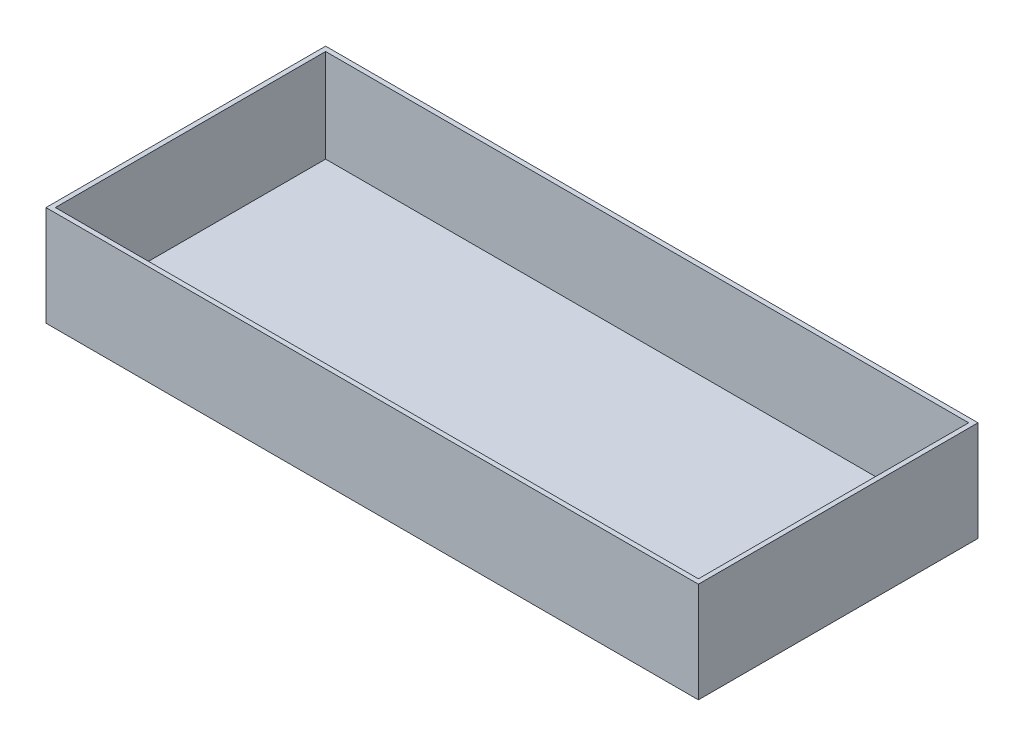
ISO-10303-21;
HEADER;
FILE_DESCRIPTION(('STEP AP214'),'2;1');
FILE_NAME('part.step','',(''),(''),'','','');
FILE_SCHEMA(('AUTOMOTIVE_DESIGN { 1 0 10303 214 1 1 1 1 }'));
ENDSEC;
DATA;
#1=APPLICATION_CONTEXT('core data for automotive mechanical design processes');
#2=APPLICATION_PROTOCOL_DEFINITION('international standard','automotive_design',2000,#1);
#3=PRODUCT_CONTEXT('',#1,'mechanical');
#4=PRODUCT('Part','Part','',(#3));
#5=PRODUCT_RELATED_PRODUCT_CATEGORY('part','',(#4));
#6=PRODUCT_DEFINITION_FORMATION('','',#4);
#7=PRODUCT_DEFINITION_CONTEXT('part definition',#1,'design');
#8=PRODUCT_DEFINITION('design','',#6,#7);
#9=PRODUCT_DEFINITION_SHAPE('','',#8);
#10=(LENGTH_UNIT() NAMED_UNIT(*) SI_UNIT(.MILLI.,.METRE.));
#11=(NAMED_UNIT(*) PLANE_ANGLE_UNIT() SI_UNIT($,.RADIAN.));
#12=(NAMED_UNIT(*) SI_UNIT($,.STERADIAN.) SOLID_ANGLE_UNIT());
#13=UNCERTAINTY_MEASURE_WITH_UNIT(LENGTH_MEASURE(1.E-05),#10,'distance_accuracy_value','');
#14=(GEOMETRIC_REPRESENTATION_CONTEXT(3) GLOBAL_UNCERTAINTY_ASSIGNED_CONTEXT((#13)) GLOBAL_UNIT_ASSIGNED_CONTEXT((#10,
#11,#12)) REPRESENTATION_CONTEXT('',''));
#15=CARTESIAN_POINT('',(0.,0.,0.));
#16=DIRECTION('',(0.,0.,1.));
#17=DIRECTION('',(1.,0.,0.));
#18=AXIS2_PLACEMENT_3D('',#15,#16,#17);
#19=CARTESIAN_POINT('',(0.,3.,0.));
#20=DIRECTION('',(1.,0.,0.));
#21=DIRECTION('',(0.,0.,-1.));
#22=AXIS2_PLACEMENT_3D('',#19,#20,#21);
#23=PLANE('',#22);
#24=DIRECTION('',(0.,0.,1.));
#25=VECTOR('',#24,1.);
#26=CARTESIAN_POINT('',(0.,0.,0.));
#27=LINE('',#26,#25);
#28=CARTESIAN_POINT('',(0.,0.,0.));
#29=VERTEX_POINT('',#28);
#30=CARTESIAN_POINT('',(0.,0.,120.));
#31=VERTEX_POINT('',#30);
#32=EDGE_CURVE('E144',#29,#31,#27,.T.);
#33=ORIENTED_EDGE('',*,*,#32,.T.);
#34=DIRECTION('',(0.,-1.,0.));
#35=VECTOR('',#34,1.);
#36=CARTESIAN_POINT('',(0.,3.,120.));
#37=LINE('',#36,#35);
#38=CARTESIAN_POINT('',(0.,43.,120.));
#39=VERTEX_POINT('',#38);
#40=EDGE_CURVE('E11',#39,#31,#37,.T.);
#41=ORIENTED_EDGE('',*,*,#40,.F.);
#42=DIRECTION('',(0.,0.,1.));
#43=VECTOR('',#42,1.);
#44=CARTESIAN_POINT('',(0.,43.,0.));
#45=LINE('',#44,#43);
#46=CARTESIAN_POINT('',(0.,43.,0.));
#47=VERTEX_POINT('',#46);
#48=EDGE_CURVE('E111',#47,#39,#45,.T.);
#49=ORIENTED_EDGE('',*,*,#48,.F.);
#50=DIRECTION('',(0.,-1.,0.));
#51=VECTOR('',#50,1.);
#52=CARTESIAN_POINT('',(0.,3.,0.));
#53=LINE('',#52,#51);
#54=EDGE_CURVE('E153',#47,#29,#53,.T.);
#55=ORIENTED_EDGE('',*,*,#54,.T.);
#56=EDGE_LOOP('',(#33,#41,#49,#55));
#57=FACE_BOUND('',#56,.T.);
#58=ADVANCED_FACE('F33',(#57),#23,.F.);
#59=CARTESIAN_POINT('',(0.,3.,120.));
#60=DIRECTION('',(0.,0.,-1.));
#61=DIRECTION('',(-1.,0.,0.));
#62=AXIS2_PLACEMENT_3D('',#59,#60,#61);
#63=PLANE('',#62);
#64=DIRECTION('',(1.,0.,0.));
#65=VECTOR('',#64,1.);
#66=CARTESIAN_POINT('',(0.,0.,120.));
#67=LINE('',#66,#65);
#68=CARTESIAN_POINT('',(280.,0.,120.));
#69=VERTEX_POINT('',#68);
#70=EDGE_CURVE('E147',#31,#69,#67,.T.);
#71=ORIENTED_EDGE('',*,*,#70,.T.);
#72=DIRECTION('',(0.,-1.,0.));
#73=VECTOR('',#72,1.);
#74=CARTESIAN_POINT('',(280.,3.,120.));
#75=LINE('',#74,#73);
#76=CARTESIAN_POINT('',(280.,43.,120.));
#77=VERTEX_POINT('',#76);
#78=EDGE_CURVE('E40',#77,#69,#75,.T.);
#79=ORIENTED_EDGE('',*,*,#78,.F.);
#80=DIRECTION('',(1.,0.,0.));
#81=VECTOR('',#80,1.);
#82=CARTESIAN_POINT('',(0.,43.,120.));
#83=LINE('',#82,#81);
#84=EDGE_CURVE('E135',#39,#77,#83,.T.);
#85=ORIENTED_EDGE('',*,*,#84,.F.);
#86=ORIENTED_EDGE('',*,*,#40,.T.);
#87=EDGE_LOOP('',(#71,#79,#85,#86));
#88=FACE_BOUND('',#87,.T.);
#89=ADVANCED_FACE('F175',(#88),#63,.F.);
#90=CARTESIAN_POINT('',(280.,3.,0.));
#91=DIRECTION('',(-1.,0.,0.));
#92=DIRECTION('',(0.,0.,1.));
#93=AXIS2_PLACEMENT_3D('',#90,#91,#92);
#94=PLANE('',#93);
#95=DIRECTION('',(0.,0.,-1.));
#96=VECTOR('',#95,1.);
#97=CARTESIAN_POINT('',(280.,0.,0.));
#98=LINE('',#97,#96);
#99=CARTESIAN_POINT('',(280.,0.,0.));
#100=VERTEX_POINT('',#99);
#101=EDGE_CURVE('E149',#69,#100,#98,.T.);
#102=ORIENTED_EDGE('',*,*,#101,.T.);
#103=DIRECTION('',(0.,-1.,0.));
#104=VECTOR('',#103,1.);
#105=CARTESIAN_POINT('',(280.,3.,0.));
#106=LINE('',#105,#104);
#107=CARTESIAN_POINT('',(280.,43.,0.));
#108=VERTEX_POINT('',#107);
#109=EDGE_CURVE('E156',#108,#100,#106,.T.);
#110=ORIENTED_EDGE('',*,*,#109,.F.);
#111=DIRECTION('',(0.,0.,-1.));
#112=VECTOR('',#111,1.);
#113=CARTESIAN_POINT('',(280.,43.,0.));
#114=LINE('',#113,#112);
#115=EDGE_CURVE('E138',#77,#108,#114,.T.);
#116=ORIENTED_EDGE('',*,*,#115,.F.);
#117=ORIENTED_EDGE('',*,*,#78,.T.);
#118=EDGE_LOOP('',(#102,#110,#116,#117));
#119=FACE_BOUND('',#118,.T.);
#120=ADVANCED_FACE('F162',(#119),#94,.F.);
#121=CARTESIAN_POINT('',(0.,3.,0.));
#122=DIRECTION('',(0.,0.,1.));
#123=DIRECTION('',(1.,0.,0.));
#124=AXIS2_PLACEMENT_3D('',#121,#122,#123);
#125=PLANE('',#124);
#126=DIRECTION('',(-1.,0.,0.));
#127=VECTOR('',#126,1.);
#128=CARTESIAN_POINT('',(0.,0.,0.));
#129=LINE('',#128,#127);
#130=EDGE_CURVE('E151',#100,#29,#129,.T.);
#131=ORIENTED_EDGE('',*,*,#130,.T.);
#132=ORIENTED_EDGE('',*,*,#54,.F.);
#133=DIRECTION('',(-1.,0.,0.));
#134=VECTOR('',#133,1.);
#135=CARTESIAN_POINT('',(0.,43.,0.));
#136=LINE('',#135,#134);
#137=EDGE_CURVE('E141',#108,#47,#136,.T.);
#138=ORIENTED_EDGE('',*,*,#137,.F.);
#139=ORIENTED_EDGE('',*,*,#109,.T.);
#140=EDGE_LOOP('',(#131,#132,#138,#139));
#141=FACE_BOUND('',#140,.T.);
#142=ADVANCED_FACE('F170',(#141),#125,.F.);
#143=CARTESIAN_POINT('',(0.,0.,0.));
#144=DIRECTION('',(0.,1.,0.));
#145=DIRECTION('',(0.,0.,1.));
#146=AXIS2_PLACEMENT_3D('',#143,#144,#145);
#147=PLANE('',#146);
#148=ORIENTED_EDGE('',*,*,#32,.F.);
#149=ORIENTED_EDGE('',*,*,#130,.F.);
#150=ORIENTED_EDGE('',*,*,#101,.F.);
#151=ORIENTED_EDGE('',*,*,#70,.F.);
#152=EDGE_LOOP('',(#148,#149,#150,#151));
#153=FACE_BOUND('',#152,.T.);
#154=ADVANCED_FACE('F168',(#153),#147,.F.);
#155=CARTESIAN_POINT('',(0.,43.,0.));
#156=DIRECTION('',(0.,1.,0.));
#157=DIRECTION('',(0.,0.,1.));
#158=AXIS2_PLACEMENT_3D('',#155,#156,#157);
#159=PLANE('',#158);
#160=ORIENTED_EDGE('',*,*,#48,.T.);
#161=ORIENTED_EDGE('',*,*,#84,.T.);
#162=ORIENTED_EDGE('',*,*,#115,.T.);
#163=ORIENTED_EDGE('',*,*,#137,.T.);
#164=EDGE_LOOP('',(#160,#161,#162,#163));
#165=FACE_BOUND('',#164,.T.);
#166=DIRECTION('',(0.,0.,1.));
#167=VECTOR('',#166,1.);
#168=CARTESIAN_POINT('',(2.,43.,2.));
#169=LINE('',#168,#167);
#170=CARTESIAN_POINT('',(2.,43.,2.));
#171=VERTEX_POINT('',#170);
#172=CARTESIAN_POINT('',(2.,43.,118.));
#173=VERTEX_POINT('',#172);
#174=EDGE_CURVE('E105',#171,#173,#169,.T.);
#175=ORIENTED_EDGE('',*,*,#174,.F.);
#176=DIRECTION('',(-1.,0.,0.));
#177=VECTOR('',#176,1.);
#178=CARTESIAN_POINT('',(2.,43.,2.));
#179=LINE('',#178,#177);
#180=CARTESIAN_POINT('',(278.,43.,2.));
#181=VERTEX_POINT('',#180);
#182=EDGE_CURVE('E96',#181,#171,#179,.T.);
#183=ORIENTED_EDGE('',*,*,#182,.F.);
#184=DIRECTION('',(0.,0.,-1.));
#185=VECTOR('',#184,1.);
#186=CARTESIAN_POINT('',(278.,43.,2.));
#187=LINE('',#186,#185);
#188=CARTESIAN_POINT('',(278.,43.,118.));
#189=VERTEX_POINT('',#188);
#190=EDGE_CURVE('E119',#189,#181,#187,.T.);
#191=ORIENTED_EDGE('',*,*,#190,.F.);
#192=DIRECTION('',(1.,0.,0.));
#193=VECTOR('',#192,1.);
#194=CARTESIAN_POINT('',(2.,43.,118.));
#195=LINE('',#194,#193);
#196=EDGE_CURVE('E117',#173,#189,#195,.T.);
#197=ORIENTED_EDGE('',*,*,#196,.F.);
#198=EDGE_LOOP('',(#175,#183,#191,#197));
#199=FACE_BOUND('',#198,.T.);
#200=ADVANCED_FACE('F115',(#165,#199),#159,.T.);
#201=CARTESIAN_POINT('',(2.,43.,2.));
#202=DIRECTION('',(0.,0.,1.));
#203=DIRECTION('',(1.,0.,0.));
#204=AXIS2_PLACEMENT_3D('',#201,#202,#203);
#205=PLANE('',#204);
#206=DIRECTION('',(-1.,0.,0.));
#207=VECTOR('',#206,1.);
#208=CARTESIAN_POINT('',(2.,3.,2.));
#209=LINE('',#208,#207);
#210=CARTESIAN_POINT('',(278.,3.,2.));
#211=VERTEX_POINT('',#210);
#212=CARTESIAN_POINT('',(2.,3.,2.));
#213=VERTEX_POINT('',#212);
#214=EDGE_CURVE('E47',#211,#213,#209,.T.);
#215=ORIENTED_EDGE('',*,*,#214,.F.);
#216=DIRECTION('',(0.,-1.,0.));
#217=VECTOR('',#216,1.);
#218=CARTESIAN_POINT('',(278.,43.,2.));
#219=LINE('',#218,#217);
#220=EDGE_CURVE('E101',#181,#211,#219,.T.);
#221=ORIENTED_EDGE('',*,*,#220,.F.);
#222=ORIENTED_EDGE('',*,*,#182,.T.);
#223=DIRECTION('',(0.,-1.,0.));
#224=VECTOR('',#223,1.);
#225=CARTESIAN_POINT('',(2.,43.,2.));
#226=LINE('',#225,#224);
#227=EDGE_CURVE('E99',#171,#213,#226,.T.);
#228=ORIENTED_EDGE('',*,*,#227,.T.);
#229=EDGE_LOOP('',(#215,#221,#222,#228));
#230=FACE_BOUND('',#229,.T.);
#231=ADVANCED_FACE('F98',(#230),#205,.T.);
#232=CARTESIAN_POINT('',(2.,43.,2.));
#233=DIRECTION('',(1.,0.,0.));
#234=DIRECTION('',(0.,0.,-1.));
#235=AXIS2_PLACEMENT_3D('',#232,#233,#234);
#236=PLANE('',#235);
#237=DIRECTION('',(0.,0.,1.));
#238=VECTOR('',#237,1.);
#239=CARTESIAN_POINT('',(2.,3.,2.));
#240=LINE('',#239,#238);
#241=CARTESIAN_POINT('',(2.,3.,118.));
#242=VERTEX_POINT('',#241);
#243=EDGE_CURVE('E51',#213,#242,#240,.T.);
#244=ORIENTED_EDGE('',*,*,#243,.F.);
#245=ORIENTED_EDGE('',*,*,#227,.F.);
#246=ORIENTED_EDGE('',*,*,#174,.T.);
#247=DIRECTION('',(0.,-1.,0.));
#248=VECTOR('',#247,1.);
#249=CARTESIAN_POINT('',(2.,43.,118.));
#250=LINE('',#249,#248);
#251=EDGE_CURVE('E112',#173,#242,#250,.T.);
#252=ORIENTED_EDGE('',*,*,#251,.T.);
#253=EDGE_LOOP('',(#244,#245,#246,#252));
#254=FACE_BOUND('',#253,.T.);
#255=ADVANCED_FACE('F109',(#254),#236,.T.);
#256=CARTESIAN_POINT('',(2.,43.,118.));
#257=DIRECTION('',(0.,0.,-1.));
#258=DIRECTION('',(-1.,0.,0.));
#259=AXIS2_PLACEMENT_3D('',#256,#257,#258);
#260=PLANE('',#259);
#261=DIRECTION('',(1.,0.,0.));
#262=VECTOR('',#261,1.);
#263=CARTESIAN_POINT('',(2.,3.,118.));
#264=LINE('',#263,#262);
#265=CARTESIAN_POINT('',(278.,3.,118.));
#266=VERTEX_POINT('',#265);
#267=EDGE_CURVE('E125',#242,#266,#264,.T.);
#268=ORIENTED_EDGE('',*,*,#267,.F.);
#269=ORIENTED_EDGE('',*,*,#251,.F.);
#270=ORIENTED_EDGE('',*,*,#196,.T.);
#271=DIRECTION('',(0.,-1.,0.));
#272=VECTOR('',#271,1.);
#273=CARTESIAN_POINT('',(278.,43.,118.));
#274=LINE('',#273,#272);
#275=EDGE_CURVE('E129',#189,#266,#274,.T.);
#276=ORIENTED_EDGE('',*,*,#275,.T.);
#277=EDGE_LOOP('',(#268,#269,#270,#276));
#278=FACE_BOUND('',#277,.T.);
#279=ADVANCED_FACE('F197',(#278),#260,.T.);
#280=CARTESIAN_POINT('',(278.,43.,2.));
#281=DIRECTION('',(-1.,0.,0.));
#282=DIRECTION('',(0.,0.,1.));
#283=AXIS2_PLACEMENT_3D('',#280,#281,#282);
#284=PLANE('',#283);
#285=DIRECTION('',(0.,0.,-1.));
#286=VECTOR('',#285,1.);
#287=CARTESIAN_POINT('',(278.,3.,2.));
#288=LINE('',#287,#286);
#289=EDGE_CURVE('E106',#266,#211,#288,.T.);
#290=ORIENTED_EDGE('',*,*,#289,.F.);
#291=ORIENTED_EDGE('',*,*,#275,.F.);
#292=ORIENTED_EDGE('',*,*,#190,.T.);
#293=ORIENTED_EDGE('',*,*,#220,.T.);
#294=EDGE_LOOP('',(#290,#291,#292,#293));
#295=FACE_BOUND('',#294,.T.);
#296=ADVANCED_FACE('F190',(#295),#284,.T.);
#297=CARTESIAN_POINT('',(0.,3.,0.));
#298=DIRECTION('',(0.,1.,0.));
#299=DIRECTION('',(0.,0.,1.));
#300=AXIS2_PLACEMENT_3D('',#297,#298,#299);
#301=PLANE('',#300);
#302=ORIENTED_EDGE('',*,*,#214,.T.);
#303=ORIENTED_EDGE('',*,*,#243,.T.);
#304=ORIENTED_EDGE('',*,*,#267,.T.);
#305=ORIENTED_EDGE('',*,*,#289,.T.);
#306=EDGE_LOOP('',(#302,#303,#304,#305));
#307=FACE_BOUND('',#306,.T.);
#308=ADVANCED_FACE('F187',(#307),#301,.T.);
#309=CLOSED_SHELL('',(#58,#89,#120,#142,#154,#200,#231,#255,#279,#296,#308));
#310=MANIFOLD_SOLID_BREP('B2',#309);
#311=ADVANCED_BREP_SHAPE_REPRESENTATION('',(#18,#310),#14);
#312=SHAPE_DEFINITION_REPRESENTATION(#9,#311);
ENDSEC;
END-ISO-10303-21;
